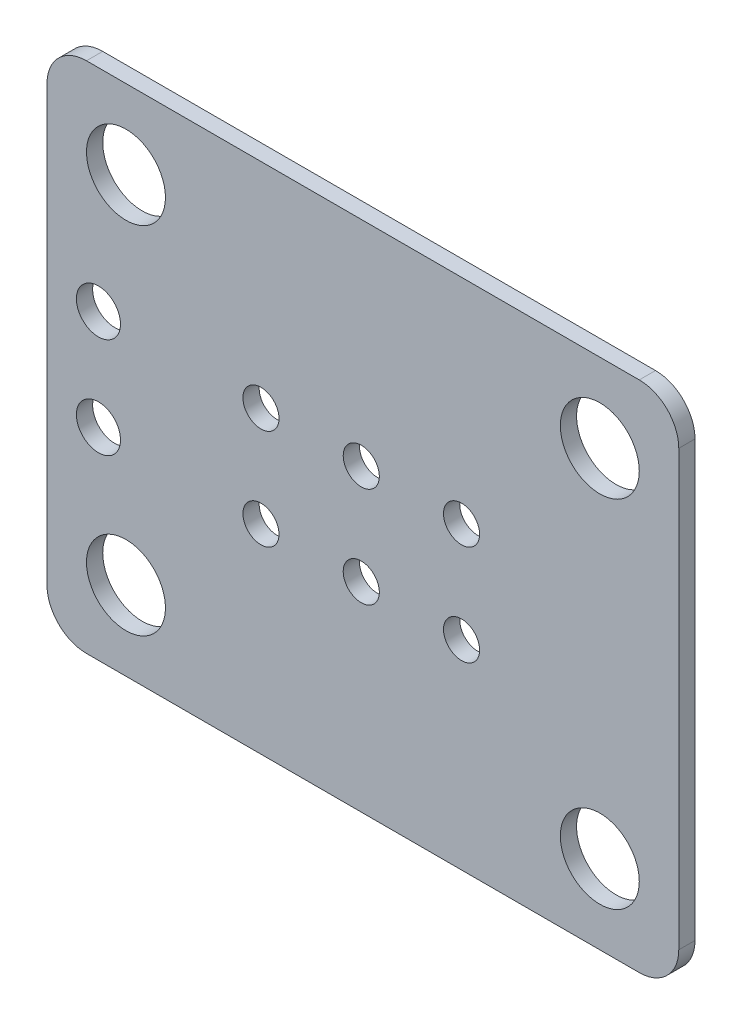
ISO-10303-21;
HEADER;
FILE_DESCRIPTION(('STEP AP214'),'2;1');
FILE_NAME('part.step','',(''),(''),'','','');
FILE_SCHEMA(('AUTOMOTIVE_DESIGN { 1 0 10303 214 1 1 1 1 }'));
ENDSEC;
DATA;
#1=APPLICATION_CONTEXT('core data for automotive mechanical design processes');
#2=APPLICATION_PROTOCOL_DEFINITION('international standard','automotive_design',2000,#1);
#3=PRODUCT_CONTEXT('',#1,'mechanical');
#4=PRODUCT('Part','Part','',(#3));
#5=PRODUCT_RELATED_PRODUCT_CATEGORY('part','',(#4));
#6=PRODUCT_DEFINITION_FORMATION('','',#4);
#7=PRODUCT_DEFINITION_CONTEXT('part definition',#1,'design');
#8=PRODUCT_DEFINITION('design','',#6,#7);
#9=PRODUCT_DEFINITION_SHAPE('','',#8);
#10=(LENGTH_UNIT() NAMED_UNIT(*) SI_UNIT(.MILLI.,.METRE.));
#11=(NAMED_UNIT(*) PLANE_ANGLE_UNIT() SI_UNIT($,.RADIAN.));
#12=(NAMED_UNIT(*) SI_UNIT($,.STERADIAN.) SOLID_ANGLE_UNIT());
#13=UNCERTAINTY_MEASURE_WITH_UNIT(LENGTH_MEASURE(1.E-05),#10,'distance_accuracy_value','');
#14=(GEOMETRIC_REPRESENTATION_CONTEXT(3) GLOBAL_UNCERTAINTY_ASSIGNED_CONTEXT((#13)) GLOBAL_UNIT_ASSIGNED_CONTEXT((#10,
#11,#12)) REPRESENTATION_CONTEXT('',''));
#15=CARTESIAN_POINT('',(0.,0.,0.));
#16=DIRECTION('',(0.,0.,1.));
#17=DIRECTION('',(1.,0.,0.));
#18=AXIS2_PLACEMENT_3D('',#15,#16,#17);
#19=CARTESIAN_POINT('',(-6.9999987,5.49999916,0.41148));
#20=DIRECTION('',(0.,0.,-1.));
#21=DIRECTION('',(-1.,0.,0.));
#22=AXIS2_PLACEMENT_3D('',#19,#20,#21);
#23=CYLINDRICAL_SURFACE('',#22,1.00000054);
#24=CARTESIAN_POINT('',(-6.9999987,5.49999916,0.));
#25=DIRECTION('',(0.,0.,1.));
#26=DIRECTION('',(-1.,0.,0.));
#27=AXIS2_PLACEMENT_3D('',#24,#25,#26);
#28=CIRCLE('',#27,1.00000054);
#29=CARTESIAN_POINT('',(-6.9999987,6.4999997,0.));
#30=VERTEX_POINT('',#29);
#31=CARTESIAN_POINT('',(-7.99999924,5.49999916,0.));
#32=VERTEX_POINT('',#31);
#33=EDGE_CURVE('E135',#30,#32,#28,.T.);
#34=ORIENTED_EDGE('',*,*,#33,.T.);
#35=DIRECTION('',(0.,0.,-1.));
#36=VECTOR('',#35,1.);
#37=CARTESIAN_POINT('',(-7.99999924,5.49999916,0.41148));
#38=LINE('',#37,#36);
#39=CARTESIAN_POINT('',(-7.99999924,5.49999916,0.41148));
#40=VERTEX_POINT('',#39);
#41=EDGE_CURVE('E11',#40,#32,#38,.T.);
#42=ORIENTED_EDGE('',*,*,#41,.F.);
#43=CARTESIAN_POINT('',(-6.9999987,5.49999916,0.41148));
#44=DIRECTION('',(0.,0.,1.));
#45=DIRECTION('',(-1.,0.,0.));
#46=AXIS2_PLACEMENT_3D('',#43,#44,#45);
#47=CIRCLE('',#46,1.00000054);
#48=CARTESIAN_POINT('',(-6.9999987,6.4999997,0.41148));
#49=VERTEX_POINT('',#48);
#50=EDGE_CURVE('E150',#49,#40,#47,.T.);
#51=ORIENTED_EDGE('',*,*,#50,.F.);
#52=DIRECTION('',(0.,0.,-1.));
#53=VECTOR('',#52,1.);
#54=CARTESIAN_POINT('',(-6.9999987,6.4999997,0.41148));
#55=LINE('',#54,#53);
#56=EDGE_CURVE('E131',#49,#30,#55,.T.);
#57=ORIENTED_EDGE('',*,*,#56,.T.);
#58=EDGE_LOOP('',(#34,#42,#51,#57));
#59=FACE_BOUND('',#58,.T.);
#60=ADVANCED_FACE('F39',(#59),#23,.T.);
#61=CARTESIAN_POINT('',(-7.99999924,-5.49999916,0.41148));
#62=DIRECTION('',(1.,0.,0.));
#63=DIRECTION('',(0.,0.,-1.));
#64=AXIS2_PLACEMENT_3D('',#61,#62,#63);
#65=PLANE('',#64);
#66=DIRECTION('',(0.,-1.,0.));
#67=VECTOR('',#66,1.);
#68=CARTESIAN_POINT('',(-7.99999924,-5.49999916,0.));
#69=LINE('',#68,#67);
#70=CARTESIAN_POINT('',(-7.99999924,-5.49999916,0.));
#71=VERTEX_POINT('',#70);
#72=EDGE_CURVE('E138',#32,#71,#69,.T.);
#73=ORIENTED_EDGE('',*,*,#72,.T.);
#74=DIRECTION('',(0.,0.,-1.));
#75=VECTOR('',#74,1.);
#76=CARTESIAN_POINT('',(-7.99999924,-5.49999916,0.41148));
#77=LINE('',#76,#75);
#78=CARTESIAN_POINT('',(-7.99999924,-5.49999916,0.41148));
#79=VERTEX_POINT('',#78);
#80=EDGE_CURVE('E47',#79,#71,#77,.T.);
#81=ORIENTED_EDGE('',*,*,#80,.F.);
#82=DIRECTION('',(0.,-1.,0.));
#83=VECTOR('',#82,1.);
#84=CARTESIAN_POINT('',(-7.99999924,-5.49999916,0.41148));
#85=LINE('',#84,#83);
#86=EDGE_CURVE('E98',#40,#79,#85,.T.);
#87=ORIENTED_EDGE('',*,*,#86,.F.);
#88=ORIENTED_EDGE('',*,*,#41,.T.);
#89=EDGE_LOOP('',(#73,#81,#87,#88));
#90=FACE_BOUND('',#89,.T.);
#91=ADVANCED_FACE('F303',(#90),#65,.F.);
#92=CARTESIAN_POINT('',(-6.99999997000081,-5.49999789000081,0.41148));
#93=DIRECTION('',(0.,0.,-1.));
#94=DIRECTION('',(-1.,0.,0.));
#95=AXIS2_PLACEMENT_3D('',#92,#93,#94);
#96=CYLINDRICAL_SURFACE('',#95,0.999999269999999);
#97=CARTESIAN_POINT('',(-6.99999997000081,-5.49999789000081,0.));
#98=DIRECTION('',(0.,0.,1.));
#99=DIRECTION('',(-1.,0.,0.));
#100=AXIS2_PLACEMENT_3D('',#97,#98,#99);
#101=CIRCLE('',#100,0.999999269999999);
#102=CARTESIAN_POINT('',(-6.9999987,-6.49999716,0.));
#103=VERTEX_POINT('',#102);
#104=EDGE_CURVE('E141',#71,#103,#101,.T.);
#105=ORIENTED_EDGE('',*,*,#104,.T.);
#106=DIRECTION('',(0.,0.,-1.));
#107=VECTOR('',#106,1.);
#108=CARTESIAN_POINT('',(-6.9999987,-6.49999716,0.41148));
#109=LINE('',#108,#107);
#110=CARTESIAN_POINT('',(-6.9999987,-6.49999716,0.41148));
#111=VERTEX_POINT('',#110);
#112=EDGE_CURVE('E157',#111,#103,#109,.T.);
#113=ORIENTED_EDGE('',*,*,#112,.F.);
#114=CARTESIAN_POINT('',(-6.99999997000081,-5.49999789000081,0.41148));
#115=DIRECTION('',(0.,0.,1.));
#116=DIRECTION('',(-1.,0.,0.));
#117=AXIS2_PLACEMENT_3D('',#114,#115,#116);
#118=CIRCLE('',#117,0.999999269999999);
#119=EDGE_CURVE('E165',#79,#111,#118,.T.);
#120=ORIENTED_EDGE('',*,*,#119,.F.);
#121=ORIENTED_EDGE('',*,*,#80,.T.);
#122=EDGE_LOOP('',(#105,#113,#120,#121));
#123=FACE_BOUND('',#122,.T.);
#124=ADVANCED_FACE('F163',(#123),#96,.T.);
#125=CARTESIAN_POINT('',(6.9999987,-6.4999997,0.41148));
#126=DIRECTION('',(1.81428605078998E-07,0.999999999999983,0.));
#127=DIRECTION('',(-0.999999999999984,1.81428605078998E-07,0.));
#128=AXIS2_PLACEMENT_3D('',#125,#126,#127);
#129=PLANE('',#128);
#130=DIRECTION('',(0.999999999999984,-1.81428605078998E-07,0.));
#131=VECTOR('',#130,1.);
#132=CARTESIAN_POINT('',(6.9999987,-6.4999997,0.));
#133=LINE('',#132,#131);
#134=CARTESIAN_POINT('',(6.9999987,-6.4999997,0.));
#135=VERTEX_POINT('',#134);
#136=EDGE_CURVE('E143',#103,#135,#133,.T.);
#137=ORIENTED_EDGE('',*,*,#136,.T.);
#138=DIRECTION('',(0.,0.,-1.));
#139=VECTOR('',#138,1.);
#140=CARTESIAN_POINT('',(6.9999987,-6.4999997,0.41148));
#141=LINE('',#140,#139);
#142=CARTESIAN_POINT('',(6.9999987,-6.4999997,0.41148));
#143=VERTEX_POINT('',#142);
#144=EDGE_CURVE('E154',#143,#135,#141,.T.);
#145=ORIENTED_EDGE('',*,*,#144,.F.);
#146=DIRECTION('',(0.999999999999984,-1.81428605078998E-07,0.));
#147=VECTOR('',#146,1.);
#148=CARTESIAN_POINT('',(6.9999987,-6.4999997,0.41148));
#149=LINE('',#148,#147);
#150=EDGE_CURVE('E177',#111,#143,#149,.T.);
#151=ORIENTED_EDGE('',*,*,#150,.F.);
#152=ORIENTED_EDGE('',*,*,#112,.T.);
#153=EDGE_LOOP('',(#137,#145,#151,#152));
#154=FACE_BOUND('',#153,.T.);
#155=ADVANCED_FACE('F173',(#154),#129,.F.);
#156=CARTESIAN_POINT('',(6.99999743000081,-5.50000043000081,0.41148));
#157=DIRECTION('',(0.,0.,-1.));
#158=DIRECTION('',(-1.,0.,0.));
#159=AXIS2_PLACEMENT_3D('',#156,#157,#158);
#160=CYLINDRICAL_SURFACE('',#159,0.999999269999999);
#161=CARTESIAN_POINT('',(6.99999743000081,-5.50000043000081,0.));
#162=DIRECTION('',(0.,0.,1.));
#163=DIRECTION('',(-1.,0.,0.));
#164=AXIS2_PLACEMENT_3D('',#161,#162,#163);
#165=CIRCLE('',#164,0.999999269999999);
#166=CARTESIAN_POINT('',(7.9999967,-5.49999916,0.));
#167=VERTEX_POINT('',#166);
#168=EDGE_CURVE('E145',#135,#167,#165,.T.);
#169=ORIENTED_EDGE('',*,*,#168,.T.);
#170=DIRECTION('',(0.,0.,-1.));
#171=VECTOR('',#170,1.);
#172=CARTESIAN_POINT('',(7.9999967,-5.49999916,0.41148));
#173=LINE('',#172,#171);
#174=CARTESIAN_POINT('',(7.9999967,-5.49999916,0.41148));
#175=VERTEX_POINT('',#174);
#176=EDGE_CURVE('E126',#175,#167,#173,.T.);
#177=ORIENTED_EDGE('',*,*,#176,.F.);
#178=CARTESIAN_POINT('',(6.99999743000081,-5.50000043000081,0.41148));
#179=DIRECTION('',(0.,0.,1.));
#180=DIRECTION('',(-1.,0.,0.));
#181=AXIS2_PLACEMENT_3D('',#178,#179,#180);
#182=CIRCLE('',#181,0.999999269999999);
#183=EDGE_CURVE('E117',#143,#175,#182,.T.);
#184=ORIENTED_EDGE('',*,*,#183,.F.);
#185=ORIENTED_EDGE('',*,*,#144,.T.);
#186=EDGE_LOOP('',(#169,#177,#184,#185));
#187=FACE_BOUND('',#186,.T.);
#188=ADVANCED_FACE('F176',(#187),#160,.T.);
#189=CARTESIAN_POINT('',(7.99999924,5.49999916,0.41148));
#190=DIRECTION('',(-0.999999999999973,2.30909126198751E-07,0.));
#191=DIRECTION('',(-2.30909126198751E-07,-0.999999999999973,0.));
#192=AXIS2_PLACEMENT_3D('',#189,#190,#191);
#193=PLANE('',#192);
#194=DIRECTION('',(2.30909126198751E-07,0.999999999999973,0.));
#195=VECTOR('',#194,1.);
#196=CARTESIAN_POINT('',(7.99999924,5.49999916,0.));
#197=LINE('',#196,#195);
#198=CARTESIAN_POINT('',(7.99999924,5.49999916,0.));
#199=VERTEX_POINT('',#198);
#200=EDGE_CURVE('E125',#167,#199,#197,.T.);
#201=ORIENTED_EDGE('',*,*,#200,.T.);
#202=DIRECTION('',(0.,0.,-1.));
#203=VECTOR('',#202,1.);
#204=CARTESIAN_POINT('',(7.99999924,5.49999916,0.41148));
#205=LINE('',#204,#203);
#206=CARTESIAN_POINT('',(7.99999924,5.49999916,0.41148));
#207=VERTEX_POINT('',#206);
#208=EDGE_CURVE('E122',#207,#199,#205,.T.);
#209=ORIENTED_EDGE('',*,*,#208,.F.);
#210=DIRECTION('',(2.30909126198751E-07,0.999999999999973,0.));
#211=VECTOR('',#210,1.);
#212=CARTESIAN_POINT('',(7.99999924,5.49999916,0.41148));
#213=LINE('',#212,#211);
#214=EDGE_CURVE('E111',#175,#207,#213,.T.);
#215=ORIENTED_EDGE('',*,*,#214,.F.);
#216=ORIENTED_EDGE('',*,*,#176,.T.);
#217=EDGE_LOOP('',(#201,#209,#215,#216));
#218=FACE_BOUND('',#217,.T.);
#219=ADVANCED_FACE('F123',(#218),#193,.F.);
#220=CARTESIAN_POINT('',(6.99999997000081,5.49999789000081,0.41148));
#221=DIRECTION('',(0.,0.,-1.));
#222=DIRECTION('',(-1.,0.,0.));
#223=AXIS2_PLACEMENT_3D('',#220,#221,#222);
#224=CYLINDRICAL_SURFACE('',#223,0.999999269999999);
#225=CARTESIAN_POINT('',(6.99999997000081,5.49999789000081,0.));
#226=DIRECTION('',(0.,0.,1.));
#227=DIRECTION('',(-1.,0.,0.));
#228=AXIS2_PLACEMENT_3D('',#225,#226,#227);
#229=CIRCLE('',#228,0.999999269999999);
#230=CARTESIAN_POINT('',(6.9999987,6.49999716,0.));
#231=VERTEX_POINT('',#230);
#232=EDGE_CURVE('E84',#199,#231,#229,.T.);
#233=ORIENTED_EDGE('',*,*,#232,.T.);
#234=DIRECTION('',(0.,0.,-1.));
#235=VECTOR('',#234,1.);
#236=CARTESIAN_POINT('',(6.9999987,6.49999716,0.41148));
#237=LINE('',#236,#235);
#238=CARTESIAN_POINT('',(6.9999987,6.49999716,0.41148));
#239=VERTEX_POINT('',#238);
#240=EDGE_CURVE('E127',#239,#231,#237,.T.);
#241=ORIENTED_EDGE('',*,*,#240,.F.);
#242=CARTESIAN_POINT('',(6.99999997000081,5.49999789000081,0.41148));
#243=DIRECTION('',(0.,0.,1.));
#244=DIRECTION('',(-1.,0.,0.));
#245=AXIS2_PLACEMENT_3D('',#242,#243,#244);
#246=CIRCLE('',#245,0.999999269999999);
#247=EDGE_CURVE('E115',#207,#239,#246,.T.);
#248=ORIENTED_EDGE('',*,*,#247,.F.);
#249=ORIENTED_EDGE('',*,*,#208,.T.);
#250=EDGE_LOOP('',(#233,#241,#248,#249));
#251=FACE_BOUND('',#250,.T.);
#252=ADVANCED_FACE('F129',(#251),#224,.T.);
#253=CARTESIAN_POINT('',(-6.9999987,6.4999997,0.41148));
#254=DIRECTION('',(-1.81428605078998E-07,-0.999999999999983,0.));
#255=DIRECTION('',(0.999999999999984,-1.81428605078998E-07,0.));
#256=AXIS2_PLACEMENT_3D('',#253,#254,#255);
#257=PLANE('',#256);
#258=DIRECTION('',(-0.999999999999984,1.81428605078998E-07,0.));
#259=VECTOR('',#258,1.);
#260=CARTESIAN_POINT('',(-6.9999987,6.4999997,0.));
#261=LINE('',#260,#259);
#262=EDGE_CURVE('E90',#231,#30,#261,.T.);
#263=ORIENTED_EDGE('',*,*,#262,.T.);
#264=ORIENTED_EDGE('',*,*,#56,.F.);
#265=DIRECTION('',(-0.999999999999984,1.81428605078998E-07,0.));
#266=VECTOR('',#265,1.);
#267=CARTESIAN_POINT('',(-6.9999987,6.4999997,0.41148));
#268=LINE('',#267,#266);
#269=EDGE_CURVE('E55',#239,#49,#268,.T.);
#270=ORIENTED_EDGE('',*,*,#269,.F.);
#271=ORIENTED_EDGE('',*,*,#240,.T.);
#272=EDGE_LOOP('',(#263,#264,#270,#271));
#273=FACE_BOUND('',#272,.T.);
#274=ADVANCED_FACE('F266',(#273),#257,.F.);
#275=CARTESIAN_POINT('',(-6.9999987,5.49999916,0.41148));
#276=DIRECTION('',(0.,0.,-1.));
#277=DIRECTION('',(-1.,0.,0.));
#278=AXIS2_PLACEMENT_3D('',#275,#276,#277);
#279=PLANE('',#278);
#280=CARTESIAN_POINT('',(5.99999816,-4.49999862,0.41148));
#281=DIRECTION('',(0.,0.,1.));
#282=DIRECTION('',(1.,0.,0.));
#283=AXIS2_PLACEMENT_3D('',#280,#281,#282);
#284=CIRCLE('',#283,0.999998);
#285=CARTESIAN_POINT('',(6.99999616,-4.49999862,0.41148));
#286=VERTEX_POINT('',#285);
#287=EDGE_CURVE('E249',#286,#286,#284,.T.);
#288=ORIENTED_EDGE('',*,*,#287,.F.);
#289=EDGE_LOOP('',(#288));
#290=FACE_BOUND('',#289,.T.);
#291=CARTESIAN_POINT('',(5.99999816,4.49999862,0.41148));
#292=DIRECTION('',(0.,0.,1.));
#293=DIRECTION('',(1.,0.,0.));
#294=AXIS2_PLACEMENT_3D('',#291,#292,#293);
#295=CIRCLE('',#294,0.999998);
#296=CARTESIAN_POINT('',(6.99999616,4.49999862,0.41148));
#297=VERTEX_POINT('',#296);
#298=EDGE_CURVE('E243',#297,#297,#295,.T.);
#299=ORIENTED_EDGE('',*,*,#298,.F.);
#300=EDGE_LOOP('',(#299));
#301=FACE_BOUND('',#300,.T.);
#302=CARTESIAN_POINT('',(-5.99999816,4.49999862,0.41148));
#303=DIRECTION('',(0.,0.,1.));
#304=DIRECTION('',(1.,0.,0.));
#305=AXIS2_PLACEMENT_3D('',#302,#303,#304);
#306=CIRCLE('',#305,0.999998);
#307=CARTESIAN_POINT('',(-5.00000016,4.49999862,0.41148));
#308=VERTEX_POINT('',#307);
#309=EDGE_CURVE('E237',#308,#308,#306,.T.);
#310=ORIENTED_EDGE('',*,*,#309,.F.);
#311=EDGE_LOOP('',(#310));
#312=FACE_BOUND('',#311,.T.);
#313=CARTESIAN_POINT('',(2.49900186,-1.4499971,0.411480000000006));
#314=DIRECTION('',(0.,0.,-1.));
#315=DIRECTION('',(-1.,0.,0.));
#316=AXIS2_PLACEMENT_3D('',#313,#314,#315);
#317=CIRCLE('',#316,0.457199999999988);
#318=CARTESIAN_POINT('',(2.04180186000001,-1.4499971,0.411480000000006));
#319=VERTEX_POINT('',#318);
#320=EDGE_CURVE('E230',#319,#319,#317,.T.);
#321=ORIENTED_EDGE('',*,*,#320,.T.);
#322=EDGE_LOOP('',(#321));
#323=FACE_BOUND('',#322,.T.);
#324=CARTESIAN_POINT('',(-0.04099814,-1.4499971,0.411480000000006));
#325=DIRECTION('',(0.,0.,-1.));
#326=DIRECTION('',(-1.,0.,0.));
#327=AXIS2_PLACEMENT_3D('',#324,#325,#326);
#328=CIRCLE('',#327,0.457199999999988);
#329=CARTESIAN_POINT('',(-0.498198139999987,-1.4499971,0.411480000000006));
#330=VERTEX_POINT('',#329);
#331=EDGE_CURVE('E224',#330,#330,#328,.T.);
#332=ORIENTED_EDGE('',*,*,#331,.T.);
#333=EDGE_LOOP('',(#332));
#334=FACE_BOUND('',#333,.T.);
#335=CARTESIAN_POINT('',(-2.58099814,-1.4499971,0.411480000000006));
#336=DIRECTION('',(0.,0.,-1.));
#337=DIRECTION('',(-1.,0.,0.));
#338=AXIS2_PLACEMENT_3D('',#335,#336,#337);
#339=CIRCLE('',#338,0.457199999999988);
#340=CARTESIAN_POINT('',(-3.03819813999999,-1.4499971,0.411480000000006));
#341=VERTEX_POINT('',#340);
#342=EDGE_CURVE('E218',#341,#341,#339,.T.);
#343=ORIENTED_EDGE('',*,*,#342,.T.);
#344=EDGE_LOOP('',(#343));
#345=FACE_BOUND('',#344,.T.);
#346=CARTESIAN_POINT('',(2.49900186,1.0900029,0.411480000000006));
#347=DIRECTION('',(0.,0.,-1.));
#348=DIRECTION('',(-1.,0.,0.));
#349=AXIS2_PLACEMENT_3D('',#346,#347,#348);
#350=CIRCLE('',#349,0.457199999999988);
#351=CARTESIAN_POINT('',(2.04180186000001,1.0900029,0.411480000000006));
#352=VERTEX_POINT('',#351);
#353=EDGE_CURVE('E212',#352,#352,#350,.T.);
#354=ORIENTED_EDGE('',*,*,#353,.T.);
#355=EDGE_LOOP('',(#354));
#356=FACE_BOUND('',#355,.T.);
#357=CARTESIAN_POINT('',(-0.04099814,1.0900029,0.411480000000006));
#358=DIRECTION('',(0.,0.,-1.));
#359=DIRECTION('',(-1.,0.,0.));
#360=AXIS2_PLACEMENT_3D('',#357,#358,#359);
#361=CIRCLE('',#360,0.457199999999988);
#362=CARTESIAN_POINT('',(-0.498198139999987,1.0900029,0.411480000000006));
#363=VERTEX_POINT('',#362);
#364=EDGE_CURVE('E206',#363,#363,#361,.T.);
#365=ORIENTED_EDGE('',*,*,#364,.T.);
#366=EDGE_LOOP('',(#365));
#367=FACE_BOUND('',#366,.T.);
#368=CARTESIAN_POINT('',(-2.58099814,1.0900029,0.411480000000006));
#369=DIRECTION('',(0.,0.,-1.));
#370=DIRECTION('',(-1.,0.,0.));
#371=AXIS2_PLACEMENT_3D('',#368,#369,#370);
#372=CIRCLE('',#371,0.457199999999988);
#373=CARTESIAN_POINT('',(-3.03819813999999,1.0900029,0.411480000000006));
#374=VERTEX_POINT('',#373);
#375=EDGE_CURVE('E200',#374,#374,#372,.T.);
#376=ORIENTED_EDGE('',*,*,#375,.T.);
#377=EDGE_LOOP('',(#376));
#378=FACE_BOUND('',#377,.T.);
#379=CARTESIAN_POINT('',(-6.69699702,1.15300252,0.411480000000006));
#380=DIRECTION('',(0.,0.,-1.));
#381=DIRECTION('',(-1.,0.,0.));
#382=AXIS2_PLACEMENT_3D('',#379,#380,#381);
#383=CIRCLE('',#382,0.558799999999988);
#384=CARTESIAN_POINT('',(-7.25579701999999,1.15300252,0.411480000000006));
#385=VERTEX_POINT('',#384);
#386=EDGE_CURVE('E194',#385,#385,#383,.T.);
#387=ORIENTED_EDGE('',*,*,#386,.T.);
#388=EDGE_LOOP('',(#387));
#389=FACE_BOUND('',#388,.T.);
#390=CARTESIAN_POINT('',(-6.69699702,-1.38699748,0.411480000000006));
#391=DIRECTION('',(0.,0.,-1.));
#392=DIRECTION('',(-1.,0.,0.));
#393=AXIS2_PLACEMENT_3D('',#390,#391,#392);
#394=CIRCLE('',#393,0.558799999999988);
#395=CARTESIAN_POINT('',(-7.25579701999999,-1.38699748,0.411480000000006));
#396=VERTEX_POINT('',#395);
#397=EDGE_CURVE('E188',#396,#396,#394,.T.);
#398=ORIENTED_EDGE('',*,*,#397,.T.);
#399=EDGE_LOOP('',(#398));
#400=FACE_BOUND('',#399,.T.);
#401=CARTESIAN_POINT('',(-5.99999816,-4.49999862,0.411480000000006));
#402=DIRECTION('',(0.,0.,-1.));
#403=DIRECTION('',(-1.,0.,0.));
#404=AXIS2_PLACEMENT_3D('',#401,#402,#403);
#405=CIRCLE('',#404,1.00000053999999);
#406=CARTESIAN_POINT('',(-6.99999869999999,-4.49999862,0.411480000000006));
#407=VERTEX_POINT('',#406);
#408=EDGE_CURVE('E139',#407,#407,#405,.T.);
#409=ORIENTED_EDGE('',*,*,#408,.T.);
#410=EDGE_LOOP('',(#409));
#411=FACE_BOUND('',#410,.T.);
#412=ORIENTED_EDGE('',*,*,#50,.T.);
#413=ORIENTED_EDGE('',*,*,#86,.T.);
#414=ORIENTED_EDGE('',*,*,#119,.T.);
#415=ORIENTED_EDGE('',*,*,#150,.T.);
#416=ORIENTED_EDGE('',*,*,#183,.T.);
#417=ORIENTED_EDGE('',*,*,#214,.T.);
#418=ORIENTED_EDGE('',*,*,#247,.T.);
#419=ORIENTED_EDGE('',*,*,#269,.T.);
#420=EDGE_LOOP('',(#412,#413,#414,#415,#416,#417,#418,#419));
#421=FACE_BOUND('',#420,.T.);
#422=ADVANCED_FACE('F113',(#290,#301,#312,#323,#334,#345,#356,#367,#378,#389,#400,#411,#421),
#279,.F.);
#423=CARTESIAN_POINT('',(-6.9999987,5.49999916,0.));
#424=DIRECTION('',(0.,0.,-1.));
#425=DIRECTION('',(-1.,0.,0.));
#426=AXIS2_PLACEMENT_3D('',#423,#424,#425);
#427=PLANE('',#426);
#428=CARTESIAN_POINT('',(5.99999816,-4.49999862,0.));
#429=DIRECTION('',(0.,0.,1.));
#430=DIRECTION('',(1.,0.,0.));
#431=AXIS2_PLACEMENT_3D('',#428,#429,#430);
#432=CIRCLE('',#431,0.999998);
#433=CARTESIAN_POINT('',(6.99999616,-4.49999862,0.));
#434=VERTEX_POINT('',#433);
#435=EDGE_CURVE('E246',#434,#434,#432,.T.);
#436=ORIENTED_EDGE('',*,*,#435,.T.);
#437=EDGE_LOOP('',(#436));
#438=FACE_BOUND('',#437,.T.);
#439=CARTESIAN_POINT('',(5.99999816,4.49999862,0.));
#440=DIRECTION('',(0.,0.,1.));
#441=DIRECTION('',(1.,0.,0.));
#442=AXIS2_PLACEMENT_3D('',#439,#440,#441);
#443=CIRCLE('',#442,0.999998);
#444=CARTESIAN_POINT('',(6.99999616,4.49999862,0.));
#445=VERTEX_POINT('',#444);
#446=EDGE_CURVE('E240',#445,#445,#443,.T.);
#447=ORIENTED_EDGE('',*,*,#446,.T.);
#448=EDGE_LOOP('',(#447));
#449=FACE_BOUND('',#448,.T.);
#450=CARTESIAN_POINT('',(-5.99999816,4.49999862,0.));
#451=DIRECTION('',(0.,0.,1.));
#452=DIRECTION('',(1.,0.,0.));
#453=AXIS2_PLACEMENT_3D('',#450,#451,#452);
#454=CIRCLE('',#453,0.999998);
#455=CARTESIAN_POINT('',(-5.00000016,4.49999862,0.));
#456=VERTEX_POINT('',#455);
#457=EDGE_CURVE('E236',#456,#456,#454,.T.);
#458=ORIENTED_EDGE('',*,*,#457,.T.);
#459=EDGE_LOOP('',(#458));
#460=FACE_BOUND('',#459,.T.);
#461=CARTESIAN_POINT('',(2.49900186,-1.4499971,0.));
#462=DIRECTION('',(0.,0.,-1.));
#463=DIRECTION('',(-1.,0.,0.));
#464=AXIS2_PLACEMENT_3D('',#461,#462,#463);
#465=CIRCLE('',#464,0.457199999999988);
#466=CARTESIAN_POINT('',(2.04180186000001,-1.4499971,0.));
#467=VERTEX_POINT('',#466);
#468=EDGE_CURVE('E233',#467,#467,#465,.T.);
#469=ORIENTED_EDGE('',*,*,#468,.F.);
#470=EDGE_LOOP('',(#469));
#471=FACE_BOUND('',#470,.T.);
#472=CARTESIAN_POINT('',(-0.04099814,-1.4499971,0.));
#473=DIRECTION('',(0.,0.,-1.));
#474=DIRECTION('',(-1.,0.,0.));
#475=AXIS2_PLACEMENT_3D('',#472,#473,#474);
#476=CIRCLE('',#475,0.457199999999988);
#477=CARTESIAN_POINT('',(-0.498198139999987,-1.4499971,0.));
#478=VERTEX_POINT('',#477);
#479=EDGE_CURVE('E227',#478,#478,#476,.T.);
#480=ORIENTED_EDGE('',*,*,#479,.F.);
#481=EDGE_LOOP('',(#480));
#482=FACE_BOUND('',#481,.T.);
#483=CARTESIAN_POINT('',(-2.58099814,-1.4499971,0.));
#484=DIRECTION('',(0.,0.,-1.));
#485=DIRECTION('',(-1.,0.,0.));
#486=AXIS2_PLACEMENT_3D('',#483,#484,#485);
#487=CIRCLE('',#486,0.457199999999988);
#488=CARTESIAN_POINT('',(-3.03819813999999,-1.4499971,0.));
#489=VERTEX_POINT('',#488);
#490=EDGE_CURVE('E221',#489,#489,#487,.T.);
#491=ORIENTED_EDGE('',*,*,#490,.F.);
#492=EDGE_LOOP('',(#491));
#493=FACE_BOUND('',#492,.T.);
#494=CARTESIAN_POINT('',(2.49900186,1.0900029,0.));
#495=DIRECTION('',(0.,0.,-1.));
#496=DIRECTION('',(-1.,0.,0.));
#497=AXIS2_PLACEMENT_3D('',#494,#495,#496);
#498=CIRCLE('',#497,0.457199999999988);
#499=CARTESIAN_POINT('',(2.04180186000001,1.0900029,0.));
#500=VERTEX_POINT('',#499);
#501=EDGE_CURVE('E215',#500,#500,#498,.T.);
#502=ORIENTED_EDGE('',*,*,#501,.F.);
#503=EDGE_LOOP('',(#502));
#504=FACE_BOUND('',#503,.T.);
#505=CARTESIAN_POINT('',(-0.04099814,1.0900029,0.));
#506=DIRECTION('',(0.,0.,-1.));
#507=DIRECTION('',(-1.,0.,0.));
#508=AXIS2_PLACEMENT_3D('',#505,#506,#507);
#509=CIRCLE('',#508,0.457199999999988);
#510=CARTESIAN_POINT('',(-0.498198139999987,1.0900029,0.));
#511=VERTEX_POINT('',#510);
#512=EDGE_CURVE('E209',#511,#511,#509,.T.);
#513=ORIENTED_EDGE('',*,*,#512,.F.);
#514=EDGE_LOOP('',(#513));
#515=FACE_BOUND('',#514,.T.);
#516=CARTESIAN_POINT('',(-2.58099814,1.0900029,0.));
#517=DIRECTION('',(0.,0.,-1.));
#518=DIRECTION('',(-1.,0.,0.));
#519=AXIS2_PLACEMENT_3D('',#516,#517,#518);
#520=CIRCLE('',#519,0.457199999999988);
#521=CARTESIAN_POINT('',(-3.03819813999999,1.0900029,0.));
#522=VERTEX_POINT('',#521);
#523=EDGE_CURVE('E203',#522,#522,#520,.T.);
#524=ORIENTED_EDGE('',*,*,#523,.F.);
#525=EDGE_LOOP('',(#524));
#526=FACE_BOUND('',#525,.T.);
#527=CARTESIAN_POINT('',(-6.69699702,1.15300252,0.));
#528=DIRECTION('',(0.,0.,-1.));
#529=DIRECTION('',(-1.,0.,0.));
#530=AXIS2_PLACEMENT_3D('',#527,#528,#529);
#531=CIRCLE('',#530,0.558799999999988);
#532=CARTESIAN_POINT('',(-7.25579701999999,1.15300252,0.));
#533=VERTEX_POINT('',#532);
#534=EDGE_CURVE('E197',#533,#533,#531,.T.);
#535=ORIENTED_EDGE('',*,*,#534,.F.);
#536=EDGE_LOOP('',(#535));
#537=FACE_BOUND('',#536,.T.);
#538=CARTESIAN_POINT('',(-6.69699702,-1.38699748,0.));
#539=DIRECTION('',(0.,0.,-1.));
#540=DIRECTION('',(-1.,0.,0.));
#541=AXIS2_PLACEMENT_3D('',#538,#539,#540);
#542=CIRCLE('',#541,0.558799999999988);
#543=CARTESIAN_POINT('',(-7.25579701999999,-1.38699748,0.));
#544=VERTEX_POINT('',#543);
#545=EDGE_CURVE('E191',#544,#544,#542,.T.);
#546=ORIENTED_EDGE('',*,*,#545,.F.);
#547=EDGE_LOOP('',(#546));
#548=FACE_BOUND('',#547,.T.);
#549=CARTESIAN_POINT('',(-5.99999816,-4.49999862,0.));
#550=DIRECTION('',(0.,0.,-1.));
#551=DIRECTION('',(-1.,0.,0.));
#552=AXIS2_PLACEMENT_3D('',#549,#550,#551);
#553=CIRCLE('',#552,1.00000053999999);
#554=CARTESIAN_POINT('',(-6.99999869999999,-4.49999862,0.));
#555=VERTEX_POINT('',#554);
#556=EDGE_CURVE('E185',#555,#555,#553,.T.);
#557=ORIENTED_EDGE('',*,*,#556,.F.);
#558=EDGE_LOOP('',(#557));
#559=FACE_BOUND('',#558,.T.);
#560=ORIENTED_EDGE('',*,*,#33,.F.);
#561=ORIENTED_EDGE('',*,*,#262,.F.);
#562=ORIENTED_EDGE('',*,*,#232,.F.);
#563=ORIENTED_EDGE('',*,*,#200,.F.);
#564=ORIENTED_EDGE('',*,*,#168,.F.);
#565=ORIENTED_EDGE('',*,*,#136,.F.);
#566=ORIENTED_EDGE('',*,*,#104,.F.);
#567=ORIENTED_EDGE('',*,*,#72,.F.);
#568=EDGE_LOOP('',(#560,#561,#562,#563,#564,#565,#566,#567));
#569=FACE_BOUND('',#568,.T.);
#570=ADVANCED_FACE('F169',(#438,#449,#460,#471,#482,#493,#504,#515,#526,#537,#548,#559,#569),
#427,.T.);
#571=CARTESIAN_POINT('',(-5.99999816,-4.49999862,0.));
#572=DIRECTION('',(0.,0.,-1.));
#573=DIRECTION('',(-1.,0.,0.));
#574=AXIS2_PLACEMENT_3D('',#571,#572,#573);
#575=CYLINDRICAL_SURFACE('',#574,1.00000053999999);
#576=ORIENTED_EDGE('',*,*,#408,.F.);
#577=EDGE_LOOP('',(#576));
#578=FACE_BOUND('',#577,.T.);
#579=ORIENTED_EDGE('',*,*,#556,.T.);
#580=EDGE_LOOP('',(#579));
#581=FACE_BOUND('',#580,.T.);
#582=ADVANCED_FACE('F290',(#578,#581),#575,.F.);
#583=CARTESIAN_POINT('',(-6.69699702,-1.38699748,0.));
#584=DIRECTION('',(0.,0.,-1.));
#585=DIRECTION('',(-1.,0.,0.));
#586=AXIS2_PLACEMENT_3D('',#583,#584,#585);
#587=CYLINDRICAL_SURFACE('',#586,0.558799999999988);
#588=ORIENTED_EDGE('',*,*,#397,.F.);
#589=EDGE_LOOP('',(#588));
#590=FACE_BOUND('',#589,.T.);
#591=ORIENTED_EDGE('',*,*,#545,.T.);
#592=EDGE_LOOP('',(#591));
#593=FACE_BOUND('',#592,.T.);
#594=ADVANCED_FACE('F293',(#590,#593),#587,.F.);
#595=CARTESIAN_POINT('',(-6.69699702,1.15300252,0.));
#596=DIRECTION('',(0.,0.,-1.));
#597=DIRECTION('',(-1.,0.,0.));
#598=AXIS2_PLACEMENT_3D('',#595,#596,#597);
#599=CYLINDRICAL_SURFACE('',#598,0.558799999999988);
#600=ORIENTED_EDGE('',*,*,#386,.F.);
#601=EDGE_LOOP('',(#600));
#602=FACE_BOUND('',#601,.T.);
#603=ORIENTED_EDGE('',*,*,#534,.T.);
#604=EDGE_LOOP('',(#603));
#605=FACE_BOUND('',#604,.T.);
#606=ADVANCED_FACE('F364',(#602,#605),#599,.F.);
#607=CARTESIAN_POINT('',(-2.58099814,1.0900029,0.));
#608=DIRECTION('',(0.,0.,-1.));
#609=DIRECTION('',(-1.,0.,0.));
#610=AXIS2_PLACEMENT_3D('',#607,#608,#609);
#611=CYLINDRICAL_SURFACE('',#610,0.457199999999988);
#612=ORIENTED_EDGE('',*,*,#375,.F.);
#613=EDGE_LOOP('',(#612));
#614=FACE_BOUND('',#613,.T.);
#615=ORIENTED_EDGE('',*,*,#523,.T.);
#616=EDGE_LOOP('',(#615));
#617=FACE_BOUND('',#616,.T.);
#618=ADVANCED_FACE('F374',(#614,#617),#611,.F.);
#619=CARTESIAN_POINT('',(-0.04099814,1.0900029,0.));
#620=DIRECTION('',(0.,0.,-1.));
#621=DIRECTION('',(-1.,0.,0.));
#622=AXIS2_PLACEMENT_3D('',#619,#620,#621);
#623=CYLINDRICAL_SURFACE('',#622,0.457199999999988);
#624=ORIENTED_EDGE('',*,*,#364,.F.);
#625=EDGE_LOOP('',(#624));
#626=FACE_BOUND('',#625,.T.);
#627=ORIENTED_EDGE('',*,*,#512,.T.);
#628=EDGE_LOOP('',(#627));
#629=FACE_BOUND('',#628,.T.);
#630=ADVANCED_FACE('F384',(#626,#629),#623,.F.);
#631=CARTESIAN_POINT('',(2.49900186,1.0900029,0.));
#632=DIRECTION('',(0.,0.,-1.));
#633=DIRECTION('',(-1.,0.,0.));
#634=AXIS2_PLACEMENT_3D('',#631,#632,#633);
#635=CYLINDRICAL_SURFACE('',#634,0.457199999999988);
#636=ORIENTED_EDGE('',*,*,#353,.F.);
#637=EDGE_LOOP('',(#636));
#638=FACE_BOUND('',#637,.T.);
#639=ORIENTED_EDGE('',*,*,#501,.T.);
#640=EDGE_LOOP('',(#639));
#641=FACE_BOUND('',#640,.T.);
#642=ADVANCED_FACE('F394',(#638,#641),#635,.F.);
#643=CARTESIAN_POINT('',(-2.58099814,-1.4499971,0.));
#644=DIRECTION('',(0.,0.,-1.));
#645=DIRECTION('',(-1.,0.,0.));
#646=AXIS2_PLACEMENT_3D('',#643,#644,#645);
#647=CYLINDRICAL_SURFACE('',#646,0.457199999999988);
#648=ORIENTED_EDGE('',*,*,#342,.F.);
#649=EDGE_LOOP('',(#648));
#650=FACE_BOUND('',#649,.T.);
#651=ORIENTED_EDGE('',*,*,#490,.T.);
#652=EDGE_LOOP('',(#651));
#653=FACE_BOUND('',#652,.T.);
#654=ADVANCED_FACE('F404',(#650,#653),#647,.F.);
#655=CARTESIAN_POINT('',(-0.04099814,-1.4499971,0.));
#656=DIRECTION('',(0.,0.,-1.));
#657=DIRECTION('',(-1.,0.,0.));
#658=AXIS2_PLACEMENT_3D('',#655,#656,#657);
#659=CYLINDRICAL_SURFACE('',#658,0.457199999999988);
#660=ORIENTED_EDGE('',*,*,#331,.F.);
#661=EDGE_LOOP('',(#660));
#662=FACE_BOUND('',#661,.T.);
#663=ORIENTED_EDGE('',*,*,#479,.T.);
#664=EDGE_LOOP('',(#663));
#665=FACE_BOUND('',#664,.T.);
#666=ADVANCED_FACE('F414',(#662,#665),#659,.F.);
#667=CARTESIAN_POINT('',(2.49900186,-1.4499971,0.));
#668=DIRECTION('',(0.,0.,-1.));
#669=DIRECTION('',(-1.,0.,0.));
#670=AXIS2_PLACEMENT_3D('',#667,#668,#669);
#671=CYLINDRICAL_SURFACE('',#670,0.457199999999988);
#672=ORIENTED_EDGE('',*,*,#320,.F.);
#673=EDGE_LOOP('',(#672));
#674=FACE_BOUND('',#673,.T.);
#675=ORIENTED_EDGE('',*,*,#468,.T.);
#676=EDGE_LOOP('',(#675));
#677=FACE_BOUND('',#676,.T.);
#678=ADVANCED_FACE('F424',(#674,#677),#671,.F.);
#679=CARTESIAN_POINT('',(-5.99999816,4.49999862,0.));
#680=DIRECTION('',(0.,0.,1.));
#681=DIRECTION('',(1.,0.,0.));
#682=AXIS2_PLACEMENT_3D('',#679,#680,#681);
#683=CYLINDRICAL_SURFACE('',#682,0.999998);
#684=CARTESIAN_POINT('',(-5.00000016,4.49999862,0.));
#685=CARTESIAN_POINT('',(-5.00000016,4.49999862,0.00428624999999849));
#686=CARTESIAN_POINT('',(-5.00000016,4.49999862,0.00857249999999852));
#687=CARTESIAN_POINT('',(-5.00000016,4.49999862,0.0171449999999985));
#688=CARTESIAN_POINT('',(-5.00000016,4.49999862,0.0214312499999986));
#689=CARTESIAN_POINT('',(-5.00000016,4.49999862,0.0300037499999986));
#690=CARTESIAN_POINT('',(-5.00000016,4.49999862,0.0342899999999986));
#691=CARTESIAN_POINT('',(-5.00000016,4.49999862,0.0428624999999986));
#692=CARTESIAN_POINT('',(-5.00000016,4.49999862,0.0471487499999987));
#693=CARTESIAN_POINT('',(-5.00000016,4.49999862,0.0557212499999987));
#694=CARTESIAN_POINT('',(-5.00000016,4.49999862,0.0600074999999987));
#695=CARTESIAN_POINT('',(-5.00000016,4.49999862,0.0685799999999987));
#696=CARTESIAN_POINT('',(-5.00000016,4.49999862,0.0728662499999987));
#697=CARTESIAN_POINT('',(-5.00000016,4.49999862,0.0814387499999988));
#698=CARTESIAN_POINT('',(-5.00000016,4.49999862,0.0857249999999988));
#699=CARTESIAN_POINT('',(-5.00000016,4.49999862,0.0942974999999988));
#700=CARTESIAN_POINT('',(-5.00000016,4.49999862,0.0985837499999989));
#701=CARTESIAN_POINT('',(-5.00000016,4.49999862,0.107156249999999));
#702=CARTESIAN_POINT('',(-5.00000016,4.49999862,0.111442499999999));
#703=CARTESIAN_POINT('',(-5.00000016,4.49999862,0.120014999999999));
#704=CARTESIAN_POINT('',(-5.00000016,4.49999862,0.124301249999999));
#705=CARTESIAN_POINT('',(-5.00000016,4.49999862,0.132873749999999));
#706=CARTESIAN_POINT('',(-5.00000016,4.49999862,0.137159999999999));
#707=CARTESIAN_POINT('',(-5.00000016,4.49999862,0.145732499999999));
#708=CARTESIAN_POINT('',(-5.00000016,4.49999862,0.150018749999999));
#709=CARTESIAN_POINT('',(-5.00000016,4.49999862,0.158591249999999));
#710=CARTESIAN_POINT('',(-5.00000016,4.49999862,0.162877499999999));
#711=CARTESIAN_POINT('',(-5.00000016,4.49999862,0.171449999999999));
#712=CARTESIAN_POINT('',(-5.00000016,4.49999862,0.175736249999999));
#713=CARTESIAN_POINT('',(-5.00000016,4.49999862,0.184308749999999));
#714=CARTESIAN_POINT('',(-5.00000016,4.49999862,0.188594999999999));
#715=CARTESIAN_POINT('',(-5.00000016,4.49999862,0.197167499999999));
#716=CARTESIAN_POINT('',(-5.00000016,4.49999862,0.201453749999999));
#717=CARTESIAN_POINT('',(-5.00000016,4.49999862,0.210026249999999));
#718=CARTESIAN_POINT('',(-5.00000016,4.49999862,0.214312499999999));
#719=CARTESIAN_POINT('',(-5.00000016,4.49999862,0.222884999999999));
#720=CARTESIAN_POINT('',(-5.00000016,4.49999862,0.227171249999999));
#721=CARTESIAN_POINT('',(-5.00000016,4.49999862,0.235743749999999));
#722=CARTESIAN_POINT('',(-5.00000016,4.49999862,0.240029999999999));
#723=CARTESIAN_POINT('',(-5.00000016,4.49999862,0.248602499999999));
#724=CARTESIAN_POINT('',(-5.00000016,4.49999862,0.252888749999999));
#725=CARTESIAN_POINT('',(-5.00000016,4.49999862,0.261461249999999));
#726=CARTESIAN_POINT('',(-5.00000016,4.49999862,0.265747499999999));
#727=CARTESIAN_POINT('',(-5.00000016,4.49999862,0.27432));
#728=CARTESIAN_POINT('',(-5.00000016,4.49999862,0.27860625));
#729=CARTESIAN_POINT('',(-5.00000016,4.49999862,0.28717875));
#730=CARTESIAN_POINT('',(-5.00000016,4.49999862,0.291465));
#731=CARTESIAN_POINT('',(-5.00000016,4.49999862,0.3000375));
#732=CARTESIAN_POINT('',(-5.00000016,4.49999862,0.30432375));
#733=CARTESIAN_POINT('',(-5.00000016,4.49999862,0.31289625));
#734=CARTESIAN_POINT('',(-5.00000016,4.49999862,0.3171825));
#735=CARTESIAN_POINT('',(-5.00000016,4.49999862,0.325755));
#736=CARTESIAN_POINT('',(-5.00000016,4.49999862,0.33004125));
#737=CARTESIAN_POINT('',(-5.00000016,4.49999862,0.33861375));
#738=CARTESIAN_POINT('',(-5.00000016,4.49999862,0.3429));
#739=CARTESIAN_POINT('',(-5.00000016,4.49999862,0.3514725));
#740=CARTESIAN_POINT('',(-5.00000016,4.49999862,0.35575875));
#741=CARTESIAN_POINT('',(-5.00000016,4.49999862,0.36433125));
#742=CARTESIAN_POINT('',(-5.00000016,4.49999862,0.3686175));
#743=CARTESIAN_POINT('',(-5.00000016,4.49999862,0.37719));
#744=CARTESIAN_POINT('',(-5.00000016,4.49999862,0.38147625));
#745=CARTESIAN_POINT('',(-5.00000016,4.49999862,0.39004875));
#746=CARTESIAN_POINT('',(-5.00000016,4.49999862,0.394335));
#747=CARTESIAN_POINT('',(-5.00000016,4.49999862,0.4029075));
#748=CARTESIAN_POINT('',(-5.00000016,4.49999862,0.40719375));
#749=CARTESIAN_POINT('',(-5.00000016,4.49999862,0.41148));
#750=B_SPLINE_CURVE_WITH_KNOTS('',3,(#684,#685,#686,#687,#688,#689,#690,#691,#692,#693,#694,
#695,#696,#697,#698,#699,#700,#701,#702,#703,#704,#705,#706,#707,#708,#709,#710,#711,#712,#713,
#714,#715,#716,#717,#718,#719,#720,#721,#722,#723,#724,#725,#726,#727,#728,#729,#730,#731,#732,
#733,#734,#735,#736,#737,#738,#739,#740,#741,#742,#743,#744,#745,#746,#747,#748,#749),
.UNSPECIFIED.,.F.,.F.,(4,2,2,2,2,2,2,2,2,2,2,2,2,2,2,2,2,2,2,2,2,2,2,2,2,2,2,2,2,2,2,2,4),(0.,
0.01285875,0.0257175000000001,0.0385762500000001,0.0514350000000002,0.0642937500000002,
0.0771525000000003,0.0900112500000003,0.10287,0.11572875,0.1285875,0.141446250000001,
0.154305000000001,0.167163750000001,0.180022500000001,0.192881250000001,0.205740000000001,
0.218598750000001,0.231457500000001,0.244316250000001,0.257175000000001,0.270033750000001,
0.282892500000001,0.295751250000001,0.308610000000001,0.321468750000001,0.334327500000001,
0.347186250000001,0.360045000000001,0.372903750000001,0.385762500000001,0.398621250000001,
0.411480000000002),.UNSPECIFIED.);
#751=EDGE_CURVE('BSEAM434',#456,#308,#750,.T.);
#752=ORIENTED_EDGE('',*,*,#457,.F.);
#753=ORIENTED_EDGE('',*,*,#309,.T.);
#754=ORIENTED_EDGE('',*,*,#751,.T.);
#755=ORIENTED_EDGE('',*,*,#751,.F.);
#756=EDGE_LOOP('',(#752,#754,#753,#755));
#757=FACE_BOUND('',#756,.T.);
#758=ADVANCED_FACE('F434',(#757),#683,.F.);
#759=CARTESIAN_POINT('',(5.99999816,4.49999862,0.));
#760=DIRECTION('',(0.,0.,1.));
#761=DIRECTION('',(1.,0.,0.));
#762=AXIS2_PLACEMENT_3D('',#759,#760,#761);
#763=CYLINDRICAL_SURFACE('',#762,0.999998);
#764=CARTESIAN_POINT('',(6.99999616,4.49999862,0.));
#765=CARTESIAN_POINT('',(6.99999616,4.49999862,0.00428624999999849));
#766=CARTESIAN_POINT('',(6.99999616,4.49999862,0.00857249999999852));
#767=CARTESIAN_POINT('',(6.99999616,4.49999862,0.0171449999999985));
#768=CARTESIAN_POINT('',(6.99999616,4.49999862,0.0214312499999986));
#769=CARTESIAN_POINT('',(6.99999616,4.49999862,0.0300037499999986));
#770=CARTESIAN_POINT('',(6.99999616,4.49999862,0.0342899999999986));
#771=CARTESIAN_POINT('',(6.99999616,4.49999862,0.0428624999999986));
#772=CARTESIAN_POINT('',(6.99999616,4.49999862,0.0471487499999987));
#773=CARTESIAN_POINT('',(6.99999616,4.49999862,0.0557212499999987));
#774=CARTESIAN_POINT('',(6.99999616,4.49999862,0.0600074999999987));
#775=CARTESIAN_POINT('',(6.99999616,4.49999862,0.0685799999999987));
#776=CARTESIAN_POINT('',(6.99999616,4.49999862,0.0728662499999987));
#777=CARTESIAN_POINT('',(6.99999616,4.49999862,0.0814387499999988));
#778=CARTESIAN_POINT('',(6.99999616,4.49999862,0.0857249999999988));
#779=CARTESIAN_POINT('',(6.99999616,4.49999862,0.0942974999999988));
#780=CARTESIAN_POINT('',(6.99999616,4.49999862,0.0985837499999989));
#781=CARTESIAN_POINT('',(6.99999616,4.49999862,0.107156249999999));
#782=CARTESIAN_POINT('',(6.99999616,4.49999862,0.111442499999999));
#783=CARTESIAN_POINT('',(6.99999616,4.49999862,0.120014999999999));
#784=CARTESIAN_POINT('',(6.99999616,4.49999862,0.124301249999999));
#785=CARTESIAN_POINT('',(6.99999616,4.49999862,0.132873749999999));
#786=CARTESIAN_POINT('',(6.99999616,4.49999862,0.137159999999999));
#787=CARTESIAN_POINT('',(6.99999616,4.49999862,0.145732499999999));
#788=CARTESIAN_POINT('',(6.99999616,4.49999862,0.150018749999999));
#789=CARTESIAN_POINT('',(6.99999616,4.49999862,0.158591249999999));
#790=CARTESIAN_POINT('',(6.99999616,4.49999862,0.162877499999999));
#791=CARTESIAN_POINT('',(6.99999616,4.49999862,0.171449999999999));
#792=CARTESIAN_POINT('',(6.99999616,4.49999862,0.175736249999999));
#793=CARTESIAN_POINT('',(6.99999616,4.49999862,0.184308749999999));
#794=CARTESIAN_POINT('',(6.99999616,4.49999862,0.188594999999999));
#795=CARTESIAN_POINT('',(6.99999616,4.49999862,0.197167499999999));
#796=CARTESIAN_POINT('',(6.99999616,4.49999862,0.201453749999999));
#797=CARTESIAN_POINT('',(6.99999616,4.49999862,0.210026249999999));
#798=CARTESIAN_POINT('',(6.99999616,4.49999862,0.214312499999999));
#799=CARTESIAN_POINT('',(6.99999616,4.49999862,0.222884999999999));
#800=CARTESIAN_POINT('',(6.99999616,4.49999862,0.227171249999999));
#801=CARTESIAN_POINT('',(6.99999616,4.49999862,0.235743749999999));
#802=CARTESIAN_POINT('',(6.99999616,4.49999862,0.240029999999999));
#803=CARTESIAN_POINT('',(6.99999616,4.49999862,0.248602499999999));
#804=CARTESIAN_POINT('',(6.99999616,4.49999862,0.252888749999999));
#805=CARTESIAN_POINT('',(6.99999616,4.49999862,0.261461249999999));
#806=CARTESIAN_POINT('',(6.99999616,4.49999862,0.265747499999999));
#807=CARTESIAN_POINT('',(6.99999616,4.49999862,0.27432));
#808=CARTESIAN_POINT('',(6.99999616,4.49999862,0.27860625));
#809=CARTESIAN_POINT('',(6.99999616,4.49999862,0.28717875));
#810=CARTESIAN_POINT('',(6.99999616,4.49999862,0.291465));
#811=CARTESIAN_POINT('',(6.99999616,4.49999862,0.3000375));
#812=CARTESIAN_POINT('',(6.99999616,4.49999862,0.30432375));
#813=CARTESIAN_POINT('',(6.99999616,4.49999862,0.31289625));
#814=CARTESIAN_POINT('',(6.99999616,4.49999862,0.3171825));
#815=CARTESIAN_POINT('',(6.99999616,4.49999862,0.325755));
#816=CARTESIAN_POINT('',(6.99999616,4.49999862,0.33004125));
#817=CARTESIAN_POINT('',(6.99999616,4.49999862,0.33861375));
#818=CARTESIAN_POINT('',(6.99999616,4.49999862,0.3429));
#819=CARTESIAN_POINT('',(6.99999616,4.49999862,0.3514725));
#820=CARTESIAN_POINT('',(6.99999616,4.49999862,0.35575875));
#821=CARTESIAN_POINT('',(6.99999616,4.49999862,0.36433125));
#822=CARTESIAN_POINT('',(6.99999616,4.49999862,0.3686175));
#823=CARTESIAN_POINT('',(6.99999616,4.49999862,0.37719));
#824=CARTESIAN_POINT('',(6.99999616,4.49999862,0.38147625));
#825=CARTESIAN_POINT('',(6.99999616,4.49999862,0.39004875));
#826=CARTESIAN_POINT('',(6.99999616,4.49999862,0.394335));
#827=CARTESIAN_POINT('',(6.99999616,4.49999862,0.4029075));
#828=CARTESIAN_POINT('',(6.99999616,4.49999862,0.40719375));
#829=CARTESIAN_POINT('',(6.99999616,4.49999862,0.41148));
#830=B_SPLINE_CURVE_WITH_KNOTS('',3,(#764,#765,#766,#767,#768,#769,#770,#771,#772,#773,#774,
#775,#776,#777,#778,#779,#780,#781,#782,#783,#784,#785,#786,#787,#788,#789,#790,#791,#792,#793,
#794,#795,#796,#797,#798,#799,#800,#801,#802,#803,#804,#805,#806,#807,#808,#809,#810,#811,#812,
#813,#814,#815,#816,#817,#818,#819,#820,#821,#822,#823,#824,#825,#826,#827,#828,#829),
.UNSPECIFIED.,.F.,.F.,(4,2,2,2,2,2,2,2,2,2,2,2,2,2,2,2,2,2,2,2,2,2,2,2,2,2,2,2,2,2,2,2,4),(0.,
0.01285875,0.0257175000000001,0.0385762500000001,0.0514350000000002,0.0642937500000002,
0.0771525000000003,0.0900112500000003,0.10287,0.11572875,0.1285875,0.141446250000001,
0.154305000000001,0.167163750000001,0.180022500000001,0.192881250000001,0.205740000000001,
0.218598750000001,0.231457500000001,0.244316250000001,0.257175000000001,0.270033750000001,
0.282892500000001,0.295751250000001,0.308610000000001,0.321468750000001,0.334327500000001,
0.347186250000001,0.360045000000001,0.372903750000001,0.385762500000001,0.398621250000001,
0.411480000000002),.UNSPECIFIED.);
#831=EDGE_CURVE('BSEAM260',#445,#297,#830,.T.);
#832=ORIENTED_EDGE('',*,*,#446,.F.);
#833=ORIENTED_EDGE('',*,*,#298,.T.);
#834=ORIENTED_EDGE('',*,*,#831,.T.);
#835=ORIENTED_EDGE('',*,*,#831,.F.);
#836=EDGE_LOOP('',(#832,#834,#833,#835));
#837=FACE_BOUND('',#836,.T.);
#838=ADVANCED_FACE('F260',(#837),#763,.F.);
#839=CARTESIAN_POINT('',(5.99999816,-4.49999862,0.));
#840=DIRECTION('',(0.,0.,1.));
#841=DIRECTION('',(1.,0.,0.));
#842=AXIS2_PLACEMENT_3D('',#839,#840,#841);
#843=CYLINDRICAL_SURFACE('',#842,0.999998);
#844=CARTESIAN_POINT('',(6.99999616,-4.49999862,0.));
#845=CARTESIAN_POINT('',(6.99999616,-4.49999862,0.00428624999999849));
#846=CARTESIAN_POINT('',(6.99999616,-4.49999862,0.00857249999999852));
#847=CARTESIAN_POINT('',(6.99999616,-4.49999862,0.0171449999999985));
#848=CARTESIAN_POINT('',(6.99999616,-4.49999862,0.0214312499999986));
#849=CARTESIAN_POINT('',(6.99999616,-4.49999862,0.0300037499999986));
#850=CARTESIAN_POINT('',(6.99999616,-4.49999862,0.0342899999999986));
#851=CARTESIAN_POINT('',(6.99999616,-4.49999862,0.0428624999999986));
#852=CARTESIAN_POINT('',(6.99999616,-4.49999862,0.0471487499999987));
#853=CARTESIAN_POINT('',(6.99999616,-4.49999862,0.0557212499999987));
#854=CARTESIAN_POINT('',(6.99999616,-4.49999862,0.0600074999999987));
#855=CARTESIAN_POINT('',(6.99999616,-4.49999862,0.0685799999999987));
#856=CARTESIAN_POINT('',(6.99999616,-4.49999862,0.0728662499999987));
#857=CARTESIAN_POINT('',(6.99999616,-4.49999862,0.0814387499999988));
#858=CARTESIAN_POINT('',(6.99999616,-4.49999862,0.0857249999999988));
#859=CARTESIAN_POINT('',(6.99999616,-4.49999862,0.0942974999999988));
#860=CARTESIAN_POINT('',(6.99999616,-4.49999862,0.0985837499999989));
#861=CARTESIAN_POINT('',(6.99999616,-4.49999862,0.107156249999999));
#862=CARTESIAN_POINT('',(6.99999616,-4.49999862,0.111442499999999));
#863=CARTESIAN_POINT('',(6.99999616,-4.49999862,0.120014999999999));
#864=CARTESIAN_POINT('',(6.99999616,-4.49999862,0.124301249999999));
#865=CARTESIAN_POINT('',(6.99999616,-4.49999862,0.132873749999999));
#866=CARTESIAN_POINT('',(6.99999616,-4.49999862,0.137159999999999));
#867=CARTESIAN_POINT('',(6.99999616,-4.49999862,0.145732499999999));
#868=CARTESIAN_POINT('',(6.99999616,-4.49999862,0.150018749999999));
#869=CARTESIAN_POINT('',(6.99999616,-4.49999862,0.158591249999999));
#870=CARTESIAN_POINT('',(6.99999616,-4.49999862,0.162877499999999));
#871=CARTESIAN_POINT('',(6.99999616,-4.49999862,0.171449999999999));
#872=CARTESIAN_POINT('',(6.99999616,-4.49999862,0.175736249999999));
#873=CARTESIAN_POINT('',(6.99999616,-4.49999862,0.184308749999999));
#874=CARTESIAN_POINT('',(6.99999616,-4.49999862,0.188594999999999));
#875=CARTESIAN_POINT('',(6.99999616,-4.49999862,0.197167499999999));
#876=CARTESIAN_POINT('',(6.99999616,-4.49999862,0.201453749999999));
#877=CARTESIAN_POINT('',(6.99999616,-4.49999862,0.210026249999999));
#878=CARTESIAN_POINT('',(6.99999616,-4.49999862,0.214312499999999));
#879=CARTESIAN_POINT('',(6.99999616,-4.49999862,0.222884999999999));
#880=CARTESIAN_POINT('',(6.99999616,-4.49999862,0.227171249999999));
#881=CARTESIAN_POINT('',(6.99999616,-4.49999862,0.235743749999999));
#882=CARTESIAN_POINT('',(6.99999616,-4.49999862,0.240029999999999));
#883=CARTESIAN_POINT('',(6.99999616,-4.49999862,0.248602499999999));
#884=CARTESIAN_POINT('',(6.99999616,-4.49999862,0.252888749999999));
#885=CARTESIAN_POINT('',(6.99999616,-4.49999862,0.261461249999999));
#886=CARTESIAN_POINT('',(6.99999616,-4.49999862,0.265747499999999));
#887=CARTESIAN_POINT('',(6.99999616,-4.49999862,0.27432));
#888=CARTESIAN_POINT('',(6.99999616,-4.49999862,0.27860625));
#889=CARTESIAN_POINT('',(6.99999616,-4.49999862,0.28717875));
#890=CARTESIAN_POINT('',(6.99999616,-4.49999862,0.291465));
#891=CARTESIAN_POINT('',(6.99999616,-4.49999862,0.3000375));
#892=CARTESIAN_POINT('',(6.99999616,-4.49999862,0.30432375));
#893=CARTESIAN_POINT('',(6.99999616,-4.49999862,0.31289625));
#894=CARTESIAN_POINT('',(6.99999616,-4.49999862,0.3171825));
#895=CARTESIAN_POINT('',(6.99999616,-4.49999862,0.325755));
#896=CARTESIAN_POINT('',(6.99999616,-4.49999862,0.33004125));
#897=CARTESIAN_POINT('',(6.99999616,-4.49999862,0.33861375));
#898=CARTESIAN_POINT('',(6.99999616,-4.49999862,0.3429));
#899=CARTESIAN_POINT('',(6.99999616,-4.49999862,0.3514725));
#900=CARTESIAN_POINT('',(6.99999616,-4.49999862,0.35575875));
#901=CARTESIAN_POINT('',(6.99999616,-4.49999862,0.36433125));
#902=CARTESIAN_POINT('',(6.99999616,-4.49999862,0.3686175));
#903=CARTESIAN_POINT('',(6.99999616,-4.49999862,0.37719));
#904=CARTESIAN_POINT('',(6.99999616,-4.49999862,0.38147625));
#905=CARTESIAN_POINT('',(6.99999616,-4.49999862,0.39004875));
#906=CARTESIAN_POINT('',(6.99999616,-4.49999862,0.394335));
#907=CARTESIAN_POINT('',(6.99999616,-4.49999862,0.4029075));
#908=CARTESIAN_POINT('',(6.99999616,-4.49999862,0.40719375));
#909=CARTESIAN_POINT('',(6.99999616,-4.49999862,0.41148));
#910=B_SPLINE_CURVE_WITH_KNOTS('',3,(#844,#845,#846,#847,#848,#849,#850,#851,#852,#853,#854,
#855,#856,#857,#858,#859,#860,#861,#862,#863,#864,#865,#866,#867,#868,#869,#870,#871,#872,#873,
#874,#875,#876,#877,#878,#879,#880,#881,#882,#883,#884,#885,#886,#887,#888,#889,#890,#891,#892,
#893,#894,#895,#896,#897,#898,#899,#900,#901,#902,#903,#904,#905,#906,#907,#908,#909),
.UNSPECIFIED.,.F.,.F.,(4,2,2,2,2,2,2,2,2,2,2,2,2,2,2,2,2,2,2,2,2,2,2,2,2,2,2,2,2,2,2,2,4),(0.,
0.01285875,0.0257175000000001,0.0385762500000001,0.0514350000000002,0.0642937500000002,
0.0771525000000003,0.0900112500000003,0.10287,0.11572875,0.1285875,0.141446250000001,
0.154305000000001,0.167163750000001,0.180022500000001,0.192881250000001,0.205740000000001,
0.218598750000001,0.231457500000001,0.244316250000001,0.257175000000001,0.270033750000001,
0.282892500000001,0.295751250000001,0.308610000000001,0.321468750000001,0.334327500000001,
0.347186250000001,0.360045000000001,0.372903750000001,0.385762500000001,0.398621250000001,
0.411480000000002),.UNSPECIFIED.);
#911=EDGE_CURVE('BSEAM257',#434,#286,#910,.T.);
#912=ORIENTED_EDGE('',*,*,#435,.F.);
#913=ORIENTED_EDGE('',*,*,#287,.T.);
#914=ORIENTED_EDGE('',*,*,#911,.T.);
#915=ORIENTED_EDGE('',*,*,#911,.F.);
#916=EDGE_LOOP('',(#912,#914,#913,#915));
#917=FACE_BOUND('',#916,.T.);
#918=ADVANCED_FACE('F257',(#917),#843,.F.);
#919=CLOSED_SHELL('',(#60,#91,#124,#155,#188,#219,#252,#274,#422,#570,#582,#594,#606,#618,#630,
#642,#654,#666,#678,#758,#838,#918));
#920=MANIFOLD_SOLID_BREP('B2',#919);
#921=ADVANCED_BREP_SHAPE_REPRESENTATION('',(#18,#920),#14);
#922=SHAPE_DEFINITION_REPRESENTATION(#9,#921);
ENDSEC;
END-ISO-10303-21;
